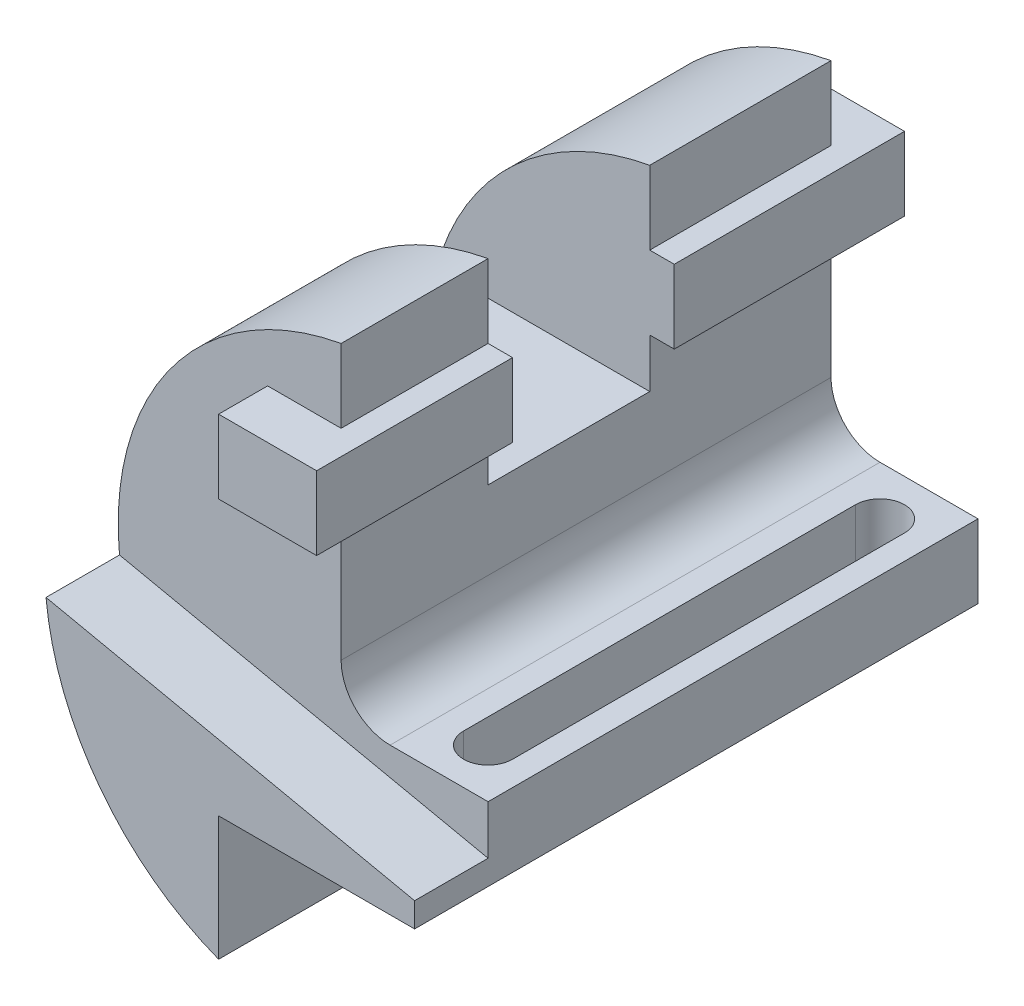
ISO-10303-21;
HEADER;
FILE_DESCRIPTION(('STEP AP214'),'2;1');
FILE_NAME('part.step','',(''),(''),'','','');
FILE_SCHEMA(('AUTOMOTIVE_DESIGN { 1 0 10303 214 1 1 1 1 }'));
ENDSEC;
DATA;
#1=APPLICATION_CONTEXT('core data for automotive mechanical design processes');
#2=APPLICATION_PROTOCOL_DEFINITION('international standard','automotive_design',2000,#1);
#3=PRODUCT_CONTEXT('',#1,'mechanical');
#4=PRODUCT('Part','Part','',(#3));
#5=PRODUCT_RELATED_PRODUCT_CATEGORY('part','',(#4));
#6=PRODUCT_DEFINITION_FORMATION('','',#4);
#7=PRODUCT_DEFINITION_CONTEXT('part definition',#1,'design');
#8=PRODUCT_DEFINITION('design','',#6,#7);
#9=PRODUCT_DEFINITION_SHAPE('','',#8);
#10=(LENGTH_UNIT() NAMED_UNIT(*) SI_UNIT(.MILLI.,.METRE.));
#11=(NAMED_UNIT(*) PLANE_ANGLE_UNIT() SI_UNIT($,.RADIAN.));
#12=(NAMED_UNIT(*) SI_UNIT($,.STERADIAN.) SOLID_ANGLE_UNIT());
#13=UNCERTAINTY_MEASURE_WITH_UNIT(LENGTH_MEASURE(1.E-05),#10,'distance_accuracy_value','');
#14=(GEOMETRIC_REPRESENTATION_CONTEXT(3) GLOBAL_UNCERTAINTY_ASSIGNED_CONTEXT((#13)) GLOBAL_UNIT_ASSIGNED_CONTEXT((#10,
#11,#12)) REPRESENTATION_CONTEXT('',''));
#15=CARTESIAN_POINT('',(0.,0.,0.));
#16=DIRECTION('',(0.,0.,1.));
#17=DIRECTION('',(1.,0.,0.));
#18=AXIS2_PLACEMENT_3D('',#15,#16,#17);
#19=CARTESIAN_POINT('',(10.,15.,115.));
#20=DIRECTION('',(-1.,0.,0.));
#21=DIRECTION('',(0.,0.,1.));
#22=AXIS2_PLACEMENT_3D('',#19,#20,#21);
#23=PLANE('',#22);
#24=DIRECTION('',(0.,0.,1.));
#25=VECTOR('',#24,1.);
#26=CARTESIAN_POINT('',(10.,66.,115.));
#27=LINE('',#26,#25);
#28=CARTESIAN_POINT('',(10.,66.,70.));
#29=VERTEX_POINT('',#28);
#30=CARTESIAN_POINT('',(10.,66.,100.));
#31=VERTEX_POINT('',#30);
#32=EDGE_CURVE('E337',#29,#31,#27,.T.);
#33=ORIENTED_EDGE('',*,*,#32,.F.);
#34=DIRECTION('',(0.,1.,0.));
#35=VECTOR('',#34,1.);
#36=CARTESIAN_POINT('',(10.,15.,70.));
#37=LINE('',#36,#35);
#38=CARTESIAN_POINT('',(9.99999999999997,81.,70.));
#39=VERTEX_POINT('',#38);
#40=EDGE_CURVE('E288',#29,#39,#37,.T.);
#41=ORIENTED_EDGE('',*,*,#40,.T.);
#42=DIRECTION('',(0.,0.,-1.));
#43=VECTOR('',#42,1.);
#44=CARTESIAN_POINT('',(10.,81.,115.));
#45=LINE('',#44,#43);
#46=CARTESIAN_POINT('',(10.,81.,100.));
#47=VERTEX_POINT('',#46);
#48=EDGE_CURVE('E448',#47,#39,#45,.T.);
#49=ORIENTED_EDGE('',*,*,#48,.F.);
#50=DIRECTION('',(0.,1.,0.));
#51=VECTOR('',#50,1.);
#52=CARTESIAN_POINT('',(10.,15.,100.));
#53=LINE('',#52,#51);
#54=EDGE_CURVE('E355',#31,#47,#53,.T.);
#55=ORIENTED_EDGE('',*,*,#54,.F.);
#56=EDGE_LOOP('',(#33,#41,#49,#55));
#57=FACE_BOUND('',#56,.T.);
#58=ADVANCED_FACE('F45',(#57),#23,.F.);
#59=CARTESIAN_POINT('',(-5.,51.,-10.));
#60=DIRECTION('',(0.,1.,0.));
#61=DIRECTION('',(-1.,0.,0.));
#62=AXIS2_PLACEMENT_3D('',#59,#60,#61);
#63=PLANE('',#62);
#64=DIRECTION('',(0.,0.,-1.));
#65=VECTOR('',#64,1.);
#66=CARTESIAN_POINT('',(10.,51.,115.));
#67=LINE('',#66,#65);
#68=CARTESIAN_POINT('',(10.,51.,100.));
#69=VERTEX_POINT('',#68);
#70=CARTESIAN_POINT('',(10.,51.,70.));
#71=VERTEX_POINT('',#70);
#72=EDGE_CURVE('E346',#69,#71,#67,.T.);
#73=ORIENTED_EDGE('',*,*,#72,.T.);
#74=DIRECTION('',(1.,0.,0.));
#75=VECTOR('',#74,1.);
#76=CARTESIAN_POINT('',(-5.,51.,70.));
#77=LINE('',#76,#75);
#78=CARTESIAN_POINT('',(15.,51.,70.));
#79=VERTEX_POINT('',#78);
#80=EDGE_CURVE('E285',#71,#79,#77,.T.);
#81=ORIENTED_EDGE('',*,*,#80,.T.);
#82=DIRECTION('',(0.,0.,1.));
#83=VECTOR('',#82,1.);
#84=CARTESIAN_POINT('',(15.,51.,-10.));
#85=LINE('',#84,#83);
#86=CARTESIAN_POINT('',(15.,51.,110.));
#87=VERTEX_POINT('',#86);
#88=EDGE_CURVE('E333',#79,#87,#85,.T.);
#89=ORIENTED_EDGE('',*,*,#88,.T.);
#90=DIRECTION('',(-1.,0.,0.));
#91=VECTOR('',#90,1.);
#92=CARTESIAN_POINT('',(-5.,51.,110.));
#93=LINE('',#92,#91);
#94=CARTESIAN_POINT('',(-5.,51.,110.));
#95=VERTEX_POINT('',#94);
#96=EDGE_CURVE('E300',#87,#95,#93,.T.);
#97=ORIENTED_EDGE('',*,*,#96,.T.);
#98=DIRECTION('',(0.,0.,1.));
#99=VECTOR('',#98,1.);
#100=CARTESIAN_POINT('',(-5.,51.,-10.));
#101=LINE('',#100,#99);
#102=CARTESIAN_POINT('',(-5.,51.,100.));
#103=VERTEX_POINT('',#102);
#104=EDGE_CURVE('E329',#103,#95,#101,.T.);
#105=ORIENTED_EDGE('',*,*,#104,.F.);
#106=DIRECTION('',(-1.,0.,0.));
#107=VECTOR('',#106,1.);
#108=CARTESIAN_POINT('',(20.,51.,100.));
#109=LINE('',#108,#107);
#110=EDGE_CURVE('E400',#69,#103,#109,.T.);
#111=ORIENTED_EDGE('',*,*,#110,.F.);
#112=EDGE_LOOP('',(#73,#81,#89,#97,#105,#111));
#113=FACE_BOUND('',#112,.T.);
#114=ADVANCED_FACE('F526',(#113),#63,.F.);
#115=CARTESIAN_POINT('',(15.,66.,-10.));
#116=DIRECTION('',(0.,-1.,0.));
#117=DIRECTION('',(0.,0.,-1.));
#118=AXIS2_PLACEMENT_3D('',#115,#116,#117);
#119=PLANE('',#118);
#120=DIRECTION('',(0.,0.,1.));
#121=VECTOR('',#120,1.);
#122=CARTESIAN_POINT('',(15.,66.,-10.));
#123=LINE('',#122,#121);
#124=CARTESIAN_POINT('',(15.,66.,70.));
#125=VERTEX_POINT('',#124);
#126=CARTESIAN_POINT('',(15.,66.,110.));
#127=VERTEX_POINT('',#126);
#128=EDGE_CURVE('E321',#125,#127,#123,.T.);
#129=ORIENTED_EDGE('',*,*,#128,.F.);
#130=DIRECTION('',(-1.,0.,0.));
#131=VECTOR('',#130,1.);
#132=CARTESIAN_POINT('',(15.,66.,70.));
#133=LINE('',#132,#131);
#134=EDGE_CURVE('E282',#125,#29,#133,.T.);
#135=ORIENTED_EDGE('',*,*,#134,.T.);
#136=ORIENTED_EDGE('',*,*,#32,.T.);
#137=DIRECTION('',(1.,0.,0.));
#138=VECTOR('',#137,1.);
#139=CARTESIAN_POINT('',(20.,66.,100.));
#140=LINE('',#139,#138);
#141=CARTESIAN_POINT('',(-5.,66.,100.));
#142=VERTEX_POINT('',#141);
#143=EDGE_CURVE('E392',#142,#31,#140,.T.);
#144=ORIENTED_EDGE('',*,*,#143,.F.);
#145=DIRECTION('',(0.,0.,1.));
#146=VECTOR('',#145,1.);
#147=CARTESIAN_POINT('',(-5.,66.,-10.));
#148=LINE('',#147,#146);
#149=CARTESIAN_POINT('',(-5.,66.,110.));
#150=VERTEX_POINT('',#149);
#151=EDGE_CURVE('E325',#142,#150,#148,.T.);
#152=ORIENTED_EDGE('',*,*,#151,.T.);
#153=DIRECTION('',(1.,0.,0.));
#154=VECTOR('',#153,1.);
#155=CARTESIAN_POINT('',(15.,66.,110.));
#156=LINE('',#155,#154);
#157=EDGE_CURVE('E308',#150,#127,#156,.T.);
#158=ORIENTED_EDGE('',*,*,#157,.T.);
#159=EDGE_LOOP('',(#129,#135,#136,#144,#152,#158));
#160=FACE_BOUND('',#159,.T.);
#161=ADVANCED_FACE('F519',(#160),#119,.F.);
#162=CARTESIAN_POINT('',(15.,51.,-10.));
#163=DIRECTION('',(-1.,0.,0.));
#164=DIRECTION('',(0.,0.,1.));
#165=AXIS2_PLACEMENT_3D('',#162,#163,#164);
#166=PLANE('',#165);
#167=ORIENTED_EDGE('',*,*,#88,.F.);
#168=DIRECTION('',(0.,1.,0.));
#169=VECTOR('',#168,1.);
#170=CARTESIAN_POINT('',(15.,51.,70.));
#171=LINE('',#170,#169);
#172=EDGE_CURVE('E406',#79,#125,#171,.T.);
#173=ORIENTED_EDGE('',*,*,#172,.T.);
#174=ORIENTED_EDGE('',*,*,#128,.T.);
#175=DIRECTION('',(0.,-1.,0.));
#176=VECTOR('',#175,1.);
#177=CARTESIAN_POINT('',(15.,51.,110.));
#178=LINE('',#177,#176);
#179=EDGE_CURVE('E304',#127,#87,#178,.T.);
#180=ORIENTED_EDGE('',*,*,#179,.T.);
#181=EDGE_LOOP('',(#167,#173,#174,#180));
#182=FACE_BOUND('',#181,.T.);
#183=ADVANCED_FACE('F534',(#182),#166,.F.);
#184=CARTESIAN_POINT('',(10.,25.,100.));
#185=VERTEX_POINT('',#184);
#186=EDGE_CURVE('E356',#185,#69,#53,.T.);
#187=ORIENTED_EDGE('',*,*,#186,.F.);
#188=DIRECTION('',(0.,0.,-1.));
#189=VECTOR('',#188,1.);
#190=CARTESIAN_POINT('',(10.,25.,0.));
#191=LINE('',#190,#189);
#192=CARTESIAN_POINT('',(10.,25.,0.));
#193=VERTEX_POINT('',#192);
#194=EDGE_CURVE('E421',#185,#193,#191,.T.);
#195=ORIENTED_EDGE('',*,*,#194,.T.);
#196=DIRECTION('',(0.,1.,0.));
#197=VECTOR('',#196,1.);
#198=CARTESIAN_POINT('',(10.,15.,0.));
#199=LINE('',#198,#197);
#200=CARTESIAN_POINT('',(10.,51.,0.));
#201=VERTEX_POINT('',#200);
#202=EDGE_CURVE('E429',#193,#201,#199,.T.);
#203=ORIENTED_EDGE('',*,*,#202,.T.);
#204=CARTESIAN_POINT('',(10.,51.,37.));
#205=VERTEX_POINT('',#204);
#206=EDGE_CURVE('E345',#205,#201,#67,.T.);
#207=ORIENTED_EDGE('',*,*,#206,.F.);
#208=DIRECTION('',(0.,-1.,0.));
#209=VECTOR('',#208,1.);
#210=CARTESIAN_POINT('',(10.,15.,37.));
#211=LINE('',#210,#209);
#212=CARTESIAN_POINT('',(10.,41.,37.));
#213=VERTEX_POINT('',#212);
#214=EDGE_CURVE('E276',#205,#213,#211,.T.);
#215=ORIENTED_EDGE('',*,*,#214,.T.);
#216=DIRECTION('',(0.,0.,1.));
#217=VECTOR('',#216,1.);
#218=CARTESIAN_POINT('',(10.,41.,115.));
#219=LINE('',#218,#217);
#220=CARTESIAN_POINT('',(10.,41.,70.));
#221=VERTEX_POINT('',#220);
#222=EDGE_CURVE('E297',#213,#221,#219,.T.);
#223=ORIENTED_EDGE('',*,*,#222,.T.);
#224=DIRECTION('',(0.,1.,0.));
#225=VECTOR('',#224,1.);
#226=CARTESIAN_POINT('',(10.,15.,70.));
#227=LINE('',#226,#225);
#228=EDGE_CURVE('E291',#221,#71,#227,.T.);
#229=ORIENTED_EDGE('',*,*,#228,.T.);
#230=ORIENTED_EDGE('',*,*,#72,.F.);
#231=EDGE_LOOP('',(#187,#195,#203,#207,#215,#223,#229,#230));
#232=FACE_BOUND('',#231,.T.);
#233=ADVANCED_FACE('F427',(#232),#23,.F.);
#234=CARTESIAN_POINT('',(9.99999999999997,81.,37.));
#235=VERTEX_POINT('',#234);
#236=CARTESIAN_POINT('',(10.,81.,0.));
#237=VERTEX_POINT('',#236);
#238=EDGE_CURVE('E447',#235,#237,#45,.T.);
#239=ORIENTED_EDGE('',*,*,#238,.F.);
#240=DIRECTION('',(0.,-1.,0.));
#241=VECTOR('',#240,1.);
#242=CARTESIAN_POINT('',(10.,15.,37.));
#243=LINE('',#242,#241);
#244=CARTESIAN_POINT('',(10.,66.,37.));
#245=VERTEX_POINT('',#244);
#246=EDGE_CURVE('E273',#235,#245,#243,.T.);
#247=ORIENTED_EDGE('',*,*,#246,.T.);
#248=CARTESIAN_POINT('',(10.,66.,0.));
#249=VERTEX_POINT('',#248);
#250=EDGE_CURVE('E338',#249,#245,#27,.T.);
#251=ORIENTED_EDGE('',*,*,#250,.F.);
#252=EDGE_CURVE('E437',#249,#237,#199,.T.);
#253=ORIENTED_EDGE('',*,*,#252,.T.);
#254=EDGE_LOOP('',(#239,#247,#251,#253));
#255=FACE_BOUND('',#254,.T.);
#256=ADVANCED_FACE('F492',(#255),#23,.F.);
#257=CARTESIAN_POINT('',(20.,26.4083339693685,0.));
#258=DIRECTION('',(0.,0.,1.));
#259=DIRECTION('',(1.,0.,0.));
#260=AXIS2_PLACEMENT_3D('',#257,#258,#259);
#261=PLANE('',#260);
#262=DIRECTION('',(-1.,0.,0.));
#263=VECTOR('',#262,1.);
#264=CARTESIAN_POINT('',(20.,51.,0.));
#265=LINE('',#264,#263);
#266=CARTESIAN_POINT('',(-5.,51.,0.));
#267=VERTEX_POINT('',#266);
#268=EDGE_CURVE('E349',#201,#267,#265,.T.);
#269=ORIENTED_EDGE('',*,*,#268,.F.);
#270=ORIENTED_EDGE('',*,*,#202,.F.);
#271=CARTESIAN_POINT('',(20.,25.,0.));
#272=DIRECTION('',(0.,0.,1.));
#273=DIRECTION('',(1.,0.,0.));
#274=AXIS2_PLACEMENT_3D('',#271,#272,#273);
#275=CIRCLE('',#274,10.);
#276=CARTESIAN_POINT('',(20.,15.,0.));
#277=VERTEX_POINT('',#276);
#278=EDGE_CURVE('E53',#193,#277,#275,.T.);
#279=ORIENTED_EDGE('',*,*,#278,.T.);
#280=DIRECTION('',(-1.,0.,0.));
#281=VECTOR('',#280,1.);
#282=CARTESIAN_POINT('',(40.,15.,0.));
#283=LINE('',#282,#281);
#284=CARTESIAN_POINT('',(40.,15.,0.));
#285=VERTEX_POINT('',#284);
#286=EDGE_CURVE('E441',#285,#277,#283,.T.);
#287=ORIENTED_EDGE('',*,*,#286,.F.);
#288=DIRECTION('',(0.,1.,0.));
#289=VECTOR('',#288,1.);
#290=CARTESIAN_POINT('',(40.,0.,0.));
#291=LINE('',#290,#289);
#292=CARTESIAN_POINT('',(40.,0.,0.));
#293=VERTEX_POINT('',#292);
#294=EDGE_CURVE('E471',#293,#285,#291,.T.);
#295=ORIENTED_EDGE('',*,*,#294,.F.);
#296=DIRECTION('',(1.,0.,0.));
#297=VECTOR('',#296,1.);
#298=CARTESIAN_POINT('',(0.,0.,0.));
#299=LINE('',#298,#297);
#300=CARTESIAN_POINT('',(0.,0.,0.));
#301=VERTEX_POINT('',#300);
#302=EDGE_CURVE('E464',#301,#293,#299,.T.);
#303=ORIENTED_EDGE('',*,*,#302,.F.);
#304=DIRECTION('',(0.,1.,0.));
#305=VECTOR('',#304,1.);
#306=CARTESIAN_POINT('',(0.,0.,0.));
#307=LINE('',#306,#305);
#308=CARTESIAN_POINT('',(0.,-25.3627969821569,0.));
#309=VERTEX_POINT('',#308);
#310=EDGE_CURVE('E369',#309,#301,#307,.T.);
#311=ORIENTED_EDGE('',*,*,#310,.F.);
#312=CARTESIAN_POINT('',(20.,26.4083339693685,0.));
#313=DIRECTION('',(0.,0.,1.));
#314=DIRECTION('',(1.,0.,0.));
#315=AXIS2_PLACEMENT_3D('',#312,#313,#314);
#316=CIRCLE('',#315,55.5);
#317=EDGE_CURVE('E374',#237,#309,#316,.T.);
#318=ORIENTED_EDGE('',*,*,#317,.F.);
#319=ORIENTED_EDGE('',*,*,#252,.F.);
#320=DIRECTION('',(1.,0.,0.));
#321=VECTOR('',#320,1.);
#322=CARTESIAN_POINT('',(20.,66.,0.));
#323=LINE('',#322,#321);
#324=CARTESIAN_POINT('',(-5.,66.,0.));
#325=VERTEX_POINT('',#324);
#326=EDGE_CURVE('E341',#325,#249,#323,.T.);
#327=ORIENTED_EDGE('',*,*,#326,.F.);
#328=DIRECTION('',(0.,1.,0.));
#329=VECTOR('',#328,1.);
#330=CARTESIAN_POINT('',(-5.,26.4083339693686,0.));
#331=LINE('',#330,#329);
#332=EDGE_CURVE('E343',#267,#325,#331,.T.);
#333=ORIENTED_EDGE('',*,*,#332,.F.);
#334=EDGE_LOOP('',(#269,#270,#279,#287,#295,#303,#311,#318,#319,#327,#333));
#335=FACE_BOUND('',#334,.T.);
#336=ADVANCED_FACE('F435',(#335),#261,.F.);
#337=CARTESIAN_POINT('',(20.,26.4083339693685,100.));
#338=DIRECTION('',(0.,0.,1.));
#339=DIRECTION('',(1.,0.,0.));
#340=AXIS2_PLACEMENT_3D('',#337,#338,#339);
#341=PLANE('',#340);
#342=DIRECTION('',(-1.,0.,0.));
#343=VECTOR('',#342,1.);
#344=CARTESIAN_POINT('',(40.,15.,100.));
#345=LINE('',#344,#343);
#346=CARTESIAN_POINT('',(40.,15.,100.));
#347=VERTEX_POINT('',#346);
#348=CARTESIAN_POINT('',(20.,15.,100.));
#349=VERTEX_POINT('',#348);
#350=EDGE_CURVE('E353',#347,#349,#345,.T.);
#351=ORIENTED_EDGE('',*,*,#350,.T.);
#352=CARTESIAN_POINT('',(20.,25.,100.));
#353=DIRECTION('',(0.,0.,1.));
#354=DIRECTION('',(1.,0.,0.));
#355=AXIS2_PLACEMENT_3D('',#352,#353,#354);
#356=CIRCLE('',#355,10.);
#357=EDGE_CURVE('E12',#349,#185,#356,.F.);
#358=ORIENTED_EDGE('',*,*,#357,.T.);
#359=ORIENTED_EDGE('',*,*,#186,.T.);
#360=ORIENTED_EDGE('',*,*,#110,.T.);
#361=DIRECTION('',(0.,1.,0.));
#362=VECTOR('',#361,1.);
#363=CARTESIAN_POINT('',(-5.,26.4083339693686,100.));
#364=LINE('',#363,#362);
#365=EDGE_CURVE('E397',#103,#142,#364,.T.);
#366=ORIENTED_EDGE('',*,*,#365,.T.);
#367=ORIENTED_EDGE('',*,*,#143,.T.);
#368=ORIENTED_EDGE('',*,*,#54,.T.);
#369=CARTESIAN_POINT('',(20.,26.4083339693685,100.));
#370=DIRECTION('',(0.,0.,1.));
#371=DIRECTION('',(1.,0.,0.));
#372=AXIS2_PLACEMENT_3D('',#369,#370,#371);
#373=CIRCLE('',#372,55.5);
#374=CARTESIAN_POINT('',(-35.2350441418964,20.9917022998936,100.));
#375=VERTEX_POINT('',#374);
#376=EDGE_CURVE('E358',#47,#375,#373,.T.);
#377=ORIENTED_EDGE('',*,*,#376,.T.);
#378=DIRECTION('',(0.978147600733806,-0.207911690817756,0.));
#379=VECTOR('',#378,1.);
#380=CARTESIAN_POINT('',(40.,5.,100.));
#381=LINE('',#380,#379);
#382=CARTESIAN_POINT('',(40.,5.,100.));
#383=VERTEX_POINT('',#382);
#384=EDGE_CURVE('E360',#375,#383,#381,.T.);
#385=ORIENTED_EDGE('',*,*,#384,.T.);
#386=DIRECTION('',(0.,1.,0.));
#387=VECTOR('',#386,1.);
#388=CARTESIAN_POINT('',(40.,5.,100.));
#389=LINE('',#388,#387);
#390=EDGE_CURVE('E351',#383,#347,#389,.T.);
#391=ORIENTED_EDGE('',*,*,#390,.T.);
#392=EDGE_LOOP('',(#351,#358,#359,#360,#366,#367,#368,#377,#385,#391));
#393=FACE_BOUND('',#392,.T.);
#394=ADVANCED_FACE('F474',(#393),#341,.T.);
#395=CARTESIAN_POINT('',(40.,0.,115.));
#396=DIRECTION('',(-1.,0.,0.));
#397=DIRECTION('',(0.,0.,1.));
#398=AXIS2_PLACEMENT_3D('',#395,#396,#397);
#399=PLANE('',#398);
#400=DIRECTION('',(0.,0.,-1.));
#401=VECTOR('',#400,1.);
#402=CARTESIAN_POINT('',(40.,5.,115.000012));
#403=LINE('',#402,#401);
#404=CARTESIAN_POINT('',(40.,5.,115.));
#405=VERTEX_POINT('',#404);
#406=EDGE_CURVE('E365',#405,#383,#403,.T.);
#407=ORIENTED_EDGE('',*,*,#406,.F.);
#408=DIRECTION('',(0.,1.,0.));
#409=VECTOR('',#408,1.);
#410=CARTESIAN_POINT('',(40.,0.,115.));
#411=LINE('',#410,#409);
#412=CARTESIAN_POINT('',(40.,0.,115.));
#413=VERTEX_POINT('',#412);
#414=EDGE_CURVE('E376',#413,#405,#411,.T.);
#415=ORIENTED_EDGE('',*,*,#414,.F.);
#416=DIRECTION('',(0.,0.,-1.));
#417=VECTOR('',#416,1.);
#418=CARTESIAN_POINT('',(40.,0.,115.));
#419=LINE('',#418,#417);
#420=EDGE_CURVE('E452',#413,#293,#419,.T.);
#421=ORIENTED_EDGE('',*,*,#420,.T.);
#422=ORIENTED_EDGE('',*,*,#294,.T.);
#423=DIRECTION('',(0.,0.,-1.));
#424=VECTOR('',#423,1.);
#425=CARTESIAN_POINT('',(40.,15.,115.));
#426=LINE('',#425,#424);
#427=EDGE_CURVE('E451',#347,#285,#426,.T.);
#428=ORIENTED_EDGE('',*,*,#427,.F.);
#429=ORIENTED_EDGE('',*,*,#390,.F.);
#430=EDGE_LOOP('',(#407,#415,#421,#422,#428,#429));
#431=FACE_BOUND('',#430,.T.);
#432=ADVANCED_FACE('F478',(#431),#399,.F.);
#433=CARTESIAN_POINT('',(40.,15.,115.));
#434=DIRECTION('',(0.,-1.,0.));
#435=DIRECTION('',(1.,0.,0.));
#436=AXIS2_PLACEMENT_3D('',#433,#434,#435);
#437=PLANE('',#436);
#438=DIRECTION('',(0.,0.,-1.));
#439=VECTOR('',#438,1.);
#440=CARTESIAN_POINT('',(25.,15.,115.));
#441=LINE('',#440,#439);
#442=CARTESIAN_POINT('',(25.,15.,90.));
#443=VERTEX_POINT('',#442);
#444=CARTESIAN_POINT('',(25.,15.,10.));
#445=VERTEX_POINT('',#444);
#446=EDGE_CURVE('E229',#443,#445,#441,.T.);
#447=ORIENTED_EDGE('',*,*,#446,.T.);
#448=CARTESIAN_POINT('',(30.,15.,10.));
#449=DIRECTION('',(0.,-1.,0.));
#450=DIRECTION('',(1.,0.,0.));
#451=AXIS2_PLACEMENT_3D('',#448,#449,#450);
#452=CIRCLE('',#451,5.);
#453=CARTESIAN_POINT('',(35.,15.,10.));
#454=VERTEX_POINT('',#453);
#455=EDGE_CURVE('E256',#445,#454,#452,.T.);
#456=ORIENTED_EDGE('',*,*,#455,.T.);
#457=DIRECTION('',(0.,0.,1.));
#458=VECTOR('',#457,1.);
#459=CARTESIAN_POINT('',(35.,15.,115.));
#460=LINE('',#459,#458);
#461=CARTESIAN_POINT('',(35.,15.,90.));
#462=VERTEX_POINT('',#461);
#463=EDGE_CURVE('E254',#454,#462,#460,.T.);
#464=ORIENTED_EDGE('',*,*,#463,.T.);
#465=CARTESIAN_POINT('',(30.,15.,90.));
#466=DIRECTION('',(0.,-1.,0.));
#467=DIRECTION('',(1.,0.,0.));
#468=AXIS2_PLACEMENT_3D('',#465,#466,#467);
#469=CIRCLE('',#468,5.);
#470=EDGE_CURVE('E240',#462,#443,#469,.T.);
#471=ORIENTED_EDGE('',*,*,#470,.T.);
#472=EDGE_LOOP('',(#447,#456,#464,#471));
#473=FACE_BOUND('',#472,.T.);
#474=ORIENTED_EDGE('',*,*,#286,.T.);
#475=DIRECTION('',(0.,0.,-1.));
#476=VECTOR('',#475,1.);
#477=CARTESIAN_POINT('',(20.,15.,100.));
#478=LINE('',#477,#476);
#479=EDGE_CURVE('E66',#277,#349,#478,.F.);
#480=ORIENTED_EDGE('',*,*,#479,.T.);
#481=ORIENTED_EDGE('',*,*,#350,.F.);
#482=ORIENTED_EDGE('',*,*,#427,.T.);
#483=EDGE_LOOP('',(#474,#480,#481,#482));
#484=FACE_BOUND('',#483,.T.);
#485=ADVANCED_FACE('F253',(#473,#484),#437,.F.);
#486=CARTESIAN_POINT('',(20.,26.4083339693685,115.));
#487=DIRECTION('',(0.,0.,-1.));
#488=DIRECTION('',(-1.,0.,0.));
#489=AXIS2_PLACEMENT_3D('',#486,#487,#488);
#490=CYLINDRICAL_SURFACE('',#489,55.5);
#491=ORIENTED_EDGE('',*,*,#48,.T.);
#492=CARTESIAN_POINT('',(20.,26.4083339693685,70.));
#493=DIRECTION('',(0.,0.,1.));
#494=DIRECTION('',(1.,0.,0.));
#495=AXIS2_PLACEMENT_3D('',#492,#493,#494);
#496=CIRCLE('',#495,55.5);
#497=CARTESIAN_POINT('',(-33.5474862383895,41.,70.));
#498=VERTEX_POINT('',#497);
#499=EDGE_CURVE('E294',#39,#498,#496,.T.);
#500=ORIENTED_EDGE('',*,*,#499,.T.);
#501=DIRECTION('',(0.,0.,-1.));
#502=VECTOR('',#501,1.);
#503=CARTESIAN_POINT('',(-33.5474862383895,41.,115.));
#504=LINE('',#503,#502);
#505=CARTESIAN_POINT('',(-33.5474862383895,41.,37.));
#506=VERTEX_POINT('',#505);
#507=EDGE_CURVE('E409',#498,#506,#504,.T.);
#508=ORIENTED_EDGE('',*,*,#507,.T.);
#509=CARTESIAN_POINT('',(20.,26.4083339693685,37.));
#510=DIRECTION('',(0.,0.,-1.));
#511=DIRECTION('',(-1.,0.,0.));
#512=AXIS2_PLACEMENT_3D('',#509,#510,#511);
#513=CIRCLE('',#512,55.5);
#514=EDGE_CURVE('E279',#506,#235,#513,.T.);
#515=ORIENTED_EDGE('',*,*,#514,.T.);
#516=ORIENTED_EDGE('',*,*,#238,.T.);
#517=ORIENTED_EDGE('',*,*,#317,.T.);
#518=DIRECTION('',(0.,0.,-1.));
#519=VECTOR('',#518,1.);
#520=CARTESIAN_POINT('',(0.,-25.3627969821569,115.));
#521=LINE('',#520,#519);
#522=CARTESIAN_POINT('',(0.,-25.3627969821569,115.));
#523=VERTEX_POINT('',#522);
#524=EDGE_CURVE('E386',#523,#309,#521,.T.);
#525=ORIENTED_EDGE('',*,*,#524,.F.);
#526=CARTESIAN_POINT('',(20.,26.4083339693685,115.));
#527=DIRECTION('',(0.,0.,1.));
#528=DIRECTION('',(1.,0.,0.));
#529=AXIS2_PLACEMENT_3D('',#526,#527,#528);
#530=CIRCLE('',#529,55.5);
#531=CARTESIAN_POINT('',(-35.2350441418964,20.9917022998936,115.));
#532=VERTEX_POINT('',#531);
#533=EDGE_CURVE('E379',#532,#523,#530,.T.);
#534=ORIENTED_EDGE('',*,*,#533,.F.);
#535=DIRECTION('',(0.,0.,1.));
#536=VECTOR('',#535,1.);
#537=CARTESIAN_POINT('',(-35.2350441418964,20.9917022998936,100.));
#538=LINE('',#537,#536);
#539=EDGE_CURVE('E363',#375,#532,#538,.T.);
#540=ORIENTED_EDGE('',*,*,#539,.F.);
#541=ORIENTED_EDGE('',*,*,#376,.F.);
#542=EDGE_LOOP('',(#491,#500,#508,#515,#516,#517,#525,#534,#540,#541));
#543=FACE_BOUND('',#542,.T.);
#544=ADVANCED_FACE('F486',(#543),#490,.T.);
#545=CARTESIAN_POINT('',(20.,26.4083339693685,115.));
#546=DIRECTION('',(0.,0.,1.));
#547=DIRECTION('',(1.,0.,0.));
#548=AXIS2_PLACEMENT_3D('',#545,#546,#547);
#549=PLANE('',#548);
#550=ORIENTED_EDGE('',*,*,#414,.T.);
#551=DIRECTION('',(-0.978147600733806,0.207911690817756,0.));
#552=VECTOR('',#551,1.);
#553=CARTESIAN_POINT('',(16.5107684773007,9.99279028873597,115.));
#554=LINE('',#553,#552);
#555=EDGE_CURVE('E389',#405,#532,#554,.T.);
#556=ORIENTED_EDGE('',*,*,#555,.T.);
#557=ORIENTED_EDGE('',*,*,#533,.T.);
#558=DIRECTION('',(0.,1.,0.));
#559=VECTOR('',#558,1.);
#560=CARTESIAN_POINT('',(0.,0.,115.));
#561=LINE('',#560,#559);
#562=CARTESIAN_POINT('',(0.,0.,115.));
#563=VERTEX_POINT('',#562);
#564=EDGE_CURVE('E370',#523,#563,#561,.T.);
#565=ORIENTED_EDGE('',*,*,#564,.T.);
#566=DIRECTION('',(1.,0.,0.));
#567=VECTOR('',#566,1.);
#568=CARTESIAN_POINT('',(0.,0.,115.));
#569=LINE('',#568,#567);
#570=EDGE_CURVE('E373',#563,#413,#569,.T.);
#571=ORIENTED_EDGE('',*,*,#570,.T.);
#572=EDGE_LOOP('',(#550,#556,#557,#565,#571));
#573=FACE_BOUND('',#572,.T.);
#574=ADVANCED_FACE('F482',(#573),#549,.T.);
#575=CARTESIAN_POINT('',(0.,0.,115.));
#576=DIRECTION('',(-1.,0.,0.));
#577=DIRECTION('',(0.,-1.,0.));
#578=AXIS2_PLACEMENT_3D('',#575,#576,#577);
#579=PLANE('',#578);
#580=ORIENTED_EDGE('',*,*,#310,.T.);
#581=DIRECTION('',(0.,0.,-1.));
#582=VECTOR('',#581,1.);
#583=CARTESIAN_POINT('',(0.,0.,115.));
#584=LINE('',#583,#582);
#585=EDGE_CURVE('E387',#563,#301,#584,.T.);
#586=ORIENTED_EDGE('',*,*,#585,.F.);
#587=ORIENTED_EDGE('',*,*,#564,.F.);
#588=ORIENTED_EDGE('',*,*,#524,.T.);
#589=EDGE_LOOP('',(#580,#586,#587,#588));
#590=FACE_BOUND('',#589,.T.);
#591=ADVANCED_FACE('F468',(#590),#579,.F.);
#592=CARTESIAN_POINT('',(0.,0.,115.));
#593=DIRECTION('',(0.,1.,0.));
#594=DIRECTION('',(0.,0.,1.));
#595=AXIS2_PLACEMENT_3D('',#592,#593,#594);
#596=PLANE('',#595);
#597=DIRECTION('',(0.,0.,-1.));
#598=VECTOR('',#597,1.);
#599=CARTESIAN_POINT('',(35.,0.,115.));
#600=LINE('',#599,#598);
#601=CARTESIAN_POINT('',(35.,0.,90.));
#602=VERTEX_POINT('',#601);
#603=CARTESIAN_POINT('',(35.,0.,10.));
#604=VERTEX_POINT('',#603);
#605=EDGE_CURVE('E415',#602,#604,#600,.T.);
#606=ORIENTED_EDGE('',*,*,#605,.T.);
#607=CARTESIAN_POINT('',(30.,0.,10.));
#608=DIRECTION('',(0.,1.,0.));
#609=DIRECTION('',(0.,0.,1.));
#610=AXIS2_PLACEMENT_3D('',#607,#608,#609);
#611=CIRCLE('',#610,5.);
#612=CARTESIAN_POINT('',(25.,0.,10.));
#613=VERTEX_POINT('',#612);
#614=EDGE_CURVE('E418',#604,#613,#611,.T.);
#615=ORIENTED_EDGE('',*,*,#614,.T.);
#616=DIRECTION('',(0.,0.,1.));
#617=VECTOR('',#616,1.);
#618=CARTESIAN_POINT('',(25.,0.,115.));
#619=LINE('',#618,#617);
#620=CARTESIAN_POINT('',(25.,0.,90.));
#621=VERTEX_POINT('',#620);
#622=EDGE_CURVE('E412',#613,#621,#619,.T.);
#623=ORIENTED_EDGE('',*,*,#622,.T.);
#624=CARTESIAN_POINT('',(30.,0.,90.));
#625=DIRECTION('',(0.,1.,0.));
#626=DIRECTION('',(0.,0.,1.));
#627=AXIS2_PLACEMENT_3D('',#624,#625,#626);
#628=CIRCLE('',#627,5.);
#629=EDGE_CURVE('E248',#621,#602,#628,.T.);
#630=ORIENTED_EDGE('',*,*,#629,.T.);
#631=EDGE_LOOP('',(#606,#615,#623,#630));
#632=FACE_BOUND('',#631,.T.);
#633=ORIENTED_EDGE('',*,*,#302,.T.);
#634=ORIENTED_EDGE('',*,*,#420,.F.);
#635=ORIENTED_EDGE('',*,*,#570,.F.);
#636=ORIENTED_EDGE('',*,*,#585,.T.);
#637=EDGE_LOOP('',(#633,#634,#635,#636));
#638=FACE_BOUND('',#637,.T.);
#639=ADVANCED_FACE('F463',(#632,#638),#596,.F.);
#640=CARTESIAN_POINT('',(40.,5.,115.000012));
#641=DIRECTION('',(0.207911690817756,0.978147600733806,0.));
#642=DIRECTION('',(-0.978147600733806,0.207911690817756,0.));
#643=AXIS2_PLACEMENT_3D('',#640,#641,#642);
#644=PLANE('',#643);
#645=ORIENTED_EDGE('',*,*,#406,.T.);
#646=ORIENTED_EDGE('',*,*,#384,.F.);
#647=ORIENTED_EDGE('',*,*,#539,.T.);
#648=ORIENTED_EDGE('',*,*,#555,.F.);
#649=EDGE_LOOP('',(#645,#646,#647,#648));
#650=FACE_BOUND('',#649,.T.);
#651=ADVANCED_FACE('F578',(#650),#644,.T.);
#652=CARTESIAN_POINT('',(15.,51.,-10.));
#653=VERTEX_POINT('',#652);
#654=CARTESIAN_POINT('',(15.,51.,37.));
#655=VERTEX_POINT('',#654);
#656=EDGE_CURVE('E334',#653,#655,#85,.T.);
#657=ORIENTED_EDGE('',*,*,#656,.T.);
#658=DIRECTION('',(-1.,0.,0.));
#659=VECTOR('',#658,1.);
#660=CARTESIAN_POINT('',(-5.,51.,37.));
#661=LINE('',#660,#659);
#662=EDGE_CURVE('E270',#655,#205,#661,.T.);
#663=ORIENTED_EDGE('',*,*,#662,.T.);
#664=ORIENTED_EDGE('',*,*,#206,.T.);
#665=ORIENTED_EDGE('',*,*,#268,.T.);
#666=CARTESIAN_POINT('',(-5.,51.,-10.));
#667=VERTEX_POINT('',#666);
#668=EDGE_CURVE('E330',#667,#267,#101,.T.);
#669=ORIENTED_EDGE('',*,*,#668,.F.);
#670=DIRECTION('',(-1.,0.,0.));
#671=VECTOR('',#670,1.);
#672=CARTESIAN_POINT('',(-5.,51.,-10.));
#673=LINE('',#672,#671);
#674=EDGE_CURVE('E315',#653,#667,#673,.T.);
#675=ORIENTED_EDGE('',*,*,#674,.F.);
#676=EDGE_LOOP('',(#657,#663,#664,#665,#669,#675));
#677=FACE_BOUND('',#676,.T.);
#678=ADVANCED_FACE('F503',(#677),#63,.F.);
#679=CARTESIAN_POINT('',(-5.,66.,-10.));
#680=DIRECTION('',(1.,0.,0.));
#681=DIRECTION('',(0.,1.,0.));
#682=AXIS2_PLACEMENT_3D('',#679,#680,#681);
#683=PLANE('',#682);
#684=ORIENTED_EDGE('',*,*,#668,.T.);
#685=ORIENTED_EDGE('',*,*,#332,.T.);
#686=CARTESIAN_POINT('',(-5.,66.,-10.));
#687=VERTEX_POINT('',#686);
#688=EDGE_CURVE('E326',#687,#325,#148,.T.);
#689=ORIENTED_EDGE('',*,*,#688,.F.);
#690=DIRECTION('',(0.,1.,0.));
#691=VECTOR('',#690,1.);
#692=CARTESIAN_POINT('',(-5.,66.,-10.));
#693=LINE('',#692,#691);
#694=EDGE_CURVE('E317',#667,#687,#693,.T.);
#695=ORIENTED_EDGE('',*,*,#694,.F.);
#696=EDGE_LOOP('',(#684,#685,#689,#695));
#697=FACE_BOUND('',#696,.T.);
#698=ADVANCED_FACE('F500',(#697),#683,.F.);
#699=ORIENTED_EDGE('',*,*,#250,.T.);
#700=DIRECTION('',(1.,0.,0.));
#701=VECTOR('',#700,1.);
#702=CARTESIAN_POINT('',(15.,66.,37.));
#703=LINE('',#702,#701);
#704=CARTESIAN_POINT('',(15.,66.,37.));
#705=VERTEX_POINT('',#704);
#706=EDGE_CURVE('E265',#245,#705,#703,.T.);
#707=ORIENTED_EDGE('',*,*,#706,.T.);
#708=CARTESIAN_POINT('',(15.,66.,-10.));
#709=VERTEX_POINT('',#708);
#710=EDGE_CURVE('E322',#709,#705,#123,.T.);
#711=ORIENTED_EDGE('',*,*,#710,.F.);
#712=DIRECTION('',(1.,0.,0.));
#713=VECTOR('',#712,1.);
#714=CARTESIAN_POINT('',(15.,66.,-10.));
#715=LINE('',#714,#713);
#716=EDGE_CURVE('E319',#687,#709,#715,.T.);
#717=ORIENTED_EDGE('',*,*,#716,.F.);
#718=ORIENTED_EDGE('',*,*,#688,.T.);
#719=ORIENTED_EDGE('',*,*,#326,.T.);
#720=EDGE_LOOP('',(#699,#707,#711,#717,#718,#719));
#721=FACE_BOUND('',#720,.T.);
#722=ADVANCED_FACE('F494',(#721),#119,.F.);
#723=ORIENTED_EDGE('',*,*,#710,.T.);
#724=DIRECTION('',(0.,-1.,0.));
#725=VECTOR('',#724,1.);
#726=CARTESIAN_POINT('',(15.,51.,37.));
#727=LINE('',#726,#725);
#728=EDGE_CURVE('E403',#705,#655,#727,.T.);
#729=ORIENTED_EDGE('',*,*,#728,.T.);
#730=ORIENTED_EDGE('',*,*,#656,.F.);
#731=DIRECTION('',(0.,-1.,0.));
#732=VECTOR('',#731,1.);
#733=CARTESIAN_POINT('',(15.,51.,-10.));
#734=LINE('',#733,#732);
#735=EDGE_CURVE('E307',#709,#653,#734,.T.);
#736=ORIENTED_EDGE('',*,*,#735,.F.);
#737=EDGE_LOOP('',(#723,#729,#730,#736));
#738=FACE_BOUND('',#737,.T.);
#739=ADVANCED_FACE('F537',(#738),#166,.F.);
#740=ORIENTED_EDGE('',*,*,#365,.F.);
#741=ORIENTED_EDGE('',*,*,#104,.T.);
#742=DIRECTION('',(0.,1.,0.));
#743=VECTOR('',#742,1.);
#744=CARTESIAN_POINT('',(-5.,66.,110.));
#745=LINE('',#744,#743);
#746=EDGE_CURVE('E303',#95,#150,#745,.T.);
#747=ORIENTED_EDGE('',*,*,#746,.T.);
#748=ORIENTED_EDGE('',*,*,#151,.F.);
#749=EDGE_LOOP('',(#740,#741,#747,#748));
#750=FACE_BOUND('',#749,.T.);
#751=ADVANCED_FACE('F523',(#750),#683,.F.);
#752=CARTESIAN_POINT('',(0.,0.,-10.));
#753=DIRECTION('',(0.,0.,1.));
#754=DIRECTION('',(1.,0.,0.));
#755=AXIS2_PLACEMENT_3D('',#752,#753,#754);
#756=PLANE('',#755);
#757=ORIENTED_EDGE('',*,*,#735,.T.);
#758=ORIENTED_EDGE('',*,*,#674,.T.);
#759=ORIENTED_EDGE('',*,*,#694,.T.);
#760=ORIENTED_EDGE('',*,*,#716,.T.);
#761=EDGE_LOOP('',(#757,#758,#759,#760));
#762=FACE_BOUND('',#761,.T.);
#763=ADVANCED_FACE('F616',(#762),#756,.F.);
#764=CARTESIAN_POINT('',(20.,26.4083339693685,110.));
#765=DIRECTION('',(0.,0.,1.));
#766=DIRECTION('',(1.,0.,0.));
#767=AXIS2_PLACEMENT_3D('',#764,#765,#766);
#768=PLANE('',#767);
#769=ORIENTED_EDGE('',*,*,#179,.F.);
#770=ORIENTED_EDGE('',*,*,#157,.F.);
#771=ORIENTED_EDGE('',*,*,#746,.F.);
#772=ORIENTED_EDGE('',*,*,#96,.F.);
#773=EDGE_LOOP('',(#769,#770,#771,#772));
#774=FACE_BOUND('',#773,.T.);
#775=ADVANCED_FACE('F531',(#774),#768,.T.);
#776=CARTESIAN_POINT('',(-35.5,41.,37.));
#777=DIRECTION('',(0.,-1.,0.));
#778=DIRECTION('',(0.,0.,-1.));
#779=AXIS2_PLACEMENT_3D('',#776,#777,#778);
#780=PLANE('',#779);
#781=DIRECTION('',(1.,0.,0.));
#782=VECTOR('',#781,1.);
#783=CARTESIAN_POINT('',(-35.5,41.,37.));
#784=LINE('',#783,#782);
#785=EDGE_CURVE('E262',#506,#213,#784,.T.);
#786=ORIENTED_EDGE('',*,*,#785,.F.);
#787=ORIENTED_EDGE('',*,*,#507,.F.);
#788=DIRECTION('',(1.,0.,0.));
#789=VECTOR('',#788,1.);
#790=CARTESIAN_POINT('',(-35.5,41.,70.));
#791=LINE('',#790,#789);
#792=EDGE_CURVE('E261',#498,#221,#791,.T.);
#793=ORIENTED_EDGE('',*,*,#792,.T.);
#794=ORIENTED_EDGE('',*,*,#222,.F.);
#795=EDGE_LOOP('',(#786,#787,#793,#794));
#796=FACE_BOUND('',#795,.T.);
#797=ADVANCED_FACE('F508',(#796),#780,.F.);
#798=CARTESIAN_POINT('',(-35.5,41.,70.));
#799=DIRECTION('',(0.,0.,1.));
#800=DIRECTION('',(1.,0.,0.));
#801=AXIS2_PLACEMENT_3D('',#798,#799,#800);
#802=PLANE('',#801);
#803=ORIENTED_EDGE('',*,*,#40,.F.);
#804=ORIENTED_EDGE('',*,*,#134,.F.);
#805=ORIENTED_EDGE('',*,*,#172,.F.);
#806=ORIENTED_EDGE('',*,*,#80,.F.);
#807=ORIENTED_EDGE('',*,*,#228,.F.);
#808=ORIENTED_EDGE('',*,*,#792,.F.);
#809=ORIENTED_EDGE('',*,*,#499,.F.);
#810=EDGE_LOOP('',(#803,#804,#805,#806,#807,#808,#809));
#811=FACE_BOUND('',#810,.T.);
#812=ADVANCED_FACE('F513',(#811),#802,.F.);
#813=CARTESIAN_POINT('',(-35.5,81.,37.));
#814=DIRECTION('',(0.,0.,-1.));
#815=DIRECTION('',(-1.,0.,0.));
#816=AXIS2_PLACEMENT_3D('',#813,#814,#815);
#817=PLANE('',#816);
#818=ORIENTED_EDGE('',*,*,#785,.T.);
#819=ORIENTED_EDGE('',*,*,#214,.F.);
#820=ORIENTED_EDGE('',*,*,#662,.F.);
#821=ORIENTED_EDGE('',*,*,#728,.F.);
#822=ORIENTED_EDGE('',*,*,#706,.F.);
#823=ORIENTED_EDGE('',*,*,#246,.F.);
#824=ORIENTED_EDGE('',*,*,#514,.F.);
#825=EDGE_LOOP('',(#818,#819,#820,#821,#822,#823,#824));
#826=FACE_BOUND('',#825,.T.);
#827=ADVANCED_FACE('F505',(#826),#817,.F.);
#828=CARTESIAN_POINT('',(30.,-25.3628219821569,10.));
#829=DIRECTION('',(0.,1.,0.));
#830=DIRECTION('',(-1.,0.,0.));
#831=AXIS2_PLACEMENT_3D('',#828,#829,#830);
#832=CYLINDRICAL_SURFACE('',#831,5.);
#833=DIRECTION('',(0.,1.,0.));
#834=VECTOR('',#833,1.);
#835=CARTESIAN_POINT('',(25.,-25.3628219821569,10.));
#836=LINE('',#835,#834);
#837=EDGE_CURVE('E235',#613,#445,#836,.T.);
#838=ORIENTED_EDGE('',*,*,#837,.F.);
#839=ORIENTED_EDGE('',*,*,#614,.F.);
#840=DIRECTION('',(0.,1.,0.));
#841=VECTOR('',#840,1.);
#842=CARTESIAN_POINT('',(35.,-25.3628219821569,10.));
#843=LINE('',#842,#841);
#844=EDGE_CURVE('E241',#604,#454,#843,.T.);
#845=ORIENTED_EDGE('',*,*,#844,.T.);
#846=ORIENTED_EDGE('',*,*,#455,.F.);
#847=EDGE_LOOP('',(#838,#839,#845,#846));
#848=FACE_BOUND('',#847,.T.);
#849=ADVANCED_FACE('F675',(#848),#832,.F.);
#850=CARTESIAN_POINT('',(35.,-25.3628219821569,10.));
#851=DIRECTION('',(1.,0.,0.));
#852=DIRECTION('',(0.,1.,0.));
#853=AXIS2_PLACEMENT_3D('',#850,#851,#852);
#854=PLANE('',#853);
#855=ORIENTED_EDGE('',*,*,#844,.F.);
#856=ORIENTED_EDGE('',*,*,#605,.F.);
#857=DIRECTION('',(0.,1.,0.));
#858=VECTOR('',#857,1.);
#859=CARTESIAN_POINT('',(35.,-25.3628219821569,90.));
#860=LINE('',#859,#858);
#861=EDGE_CURVE('E250',#602,#462,#860,.T.);
#862=ORIENTED_EDGE('',*,*,#861,.T.);
#863=ORIENTED_EDGE('',*,*,#463,.F.);
#864=EDGE_LOOP('',(#855,#856,#862,#863));
#865=FACE_BOUND('',#864,.T.);
#866=ADVANCED_FACE('F684',(#865),#854,.F.);
#867=CARTESIAN_POINT('',(30.,-25.3628219821569,90.));
#868=DIRECTION('',(0.,1.,0.));
#869=DIRECTION('',(-1.,0.,0.));
#870=AXIS2_PLACEMENT_3D('',#867,#868,#869);
#871=CYLINDRICAL_SURFACE('',#870,5.);
#872=ORIENTED_EDGE('',*,*,#861,.F.);
#873=ORIENTED_EDGE('',*,*,#629,.F.);
#874=DIRECTION('',(0.,1.,0.));
#875=VECTOR('',#874,1.);
#876=CARTESIAN_POINT('',(25.,-25.3628219821569,90.));
#877=LINE('',#876,#875);
#878=EDGE_CURVE('E232',#621,#443,#877,.T.);
#879=ORIENTED_EDGE('',*,*,#878,.T.);
#880=ORIENTED_EDGE('',*,*,#470,.F.);
#881=EDGE_LOOP('',(#872,#873,#879,#880));
#882=FACE_BOUND('',#881,.T.);
#883=ADVANCED_FACE('F245',(#882),#871,.F.);
#884=CARTESIAN_POINT('',(25.,-25.3628219821569,10.));
#885=DIRECTION('',(-1.,0.,0.));
#886=DIRECTION('',(0.,0.,1.));
#887=AXIS2_PLACEMENT_3D('',#884,#885,#886);
#888=PLANE('',#887);
#889=ORIENTED_EDGE('',*,*,#878,.F.);
#890=ORIENTED_EDGE('',*,*,#622,.F.);
#891=ORIENTED_EDGE('',*,*,#837,.T.);
#892=ORIENTED_EDGE('',*,*,#446,.F.);
#893=EDGE_LOOP('',(#889,#890,#891,#892));
#894=FACE_BOUND('',#893,.T.);
#895=ADVANCED_FACE('F231',(#894),#888,.F.);
#896=CARTESIAN_POINT('',(20.,25.,115.));
#897=DIRECTION('',(0.,0.,1.));
#898=DIRECTION('',(1.,0.,0.));
#899=AXIS2_PLACEMENT_3D('',#896,#897,#898);
#900=CYLINDRICAL_SURFACE('',#899,10.);
#901=ORIENTED_EDGE('',*,*,#357,.F.);
#902=ORIENTED_EDGE('',*,*,#479,.F.);
#903=ORIENTED_EDGE('',*,*,#278,.F.);
#904=ORIENTED_EDGE('',*,*,#194,.F.);
#905=EDGE_LOOP('',(#901,#902,#903,#904));
#906=FACE_BOUND('',#905,.T.);
#907=ADVANCED_FACE('F47',(#906),#900,.F.);
#908=CLOSED_SHELL('',(#58,#114,#161,#183,#233,#256,#336,#394,#432,#485,#544,#574,#591,#639,#651,
#678,#698,#722,#739,#751,#763,#775,#797,#812,#827,#849,#866,#883,#895,#907));
#909=MANIFOLD_SOLID_BREP('B2',#908);
#910=ADVANCED_BREP_SHAPE_REPRESENTATION('',(#18,#909),#14);
#911=SHAPE_DEFINITION_REPRESENTATION(#9,#910);
ENDSEC;
END-ISO-10303-21;
